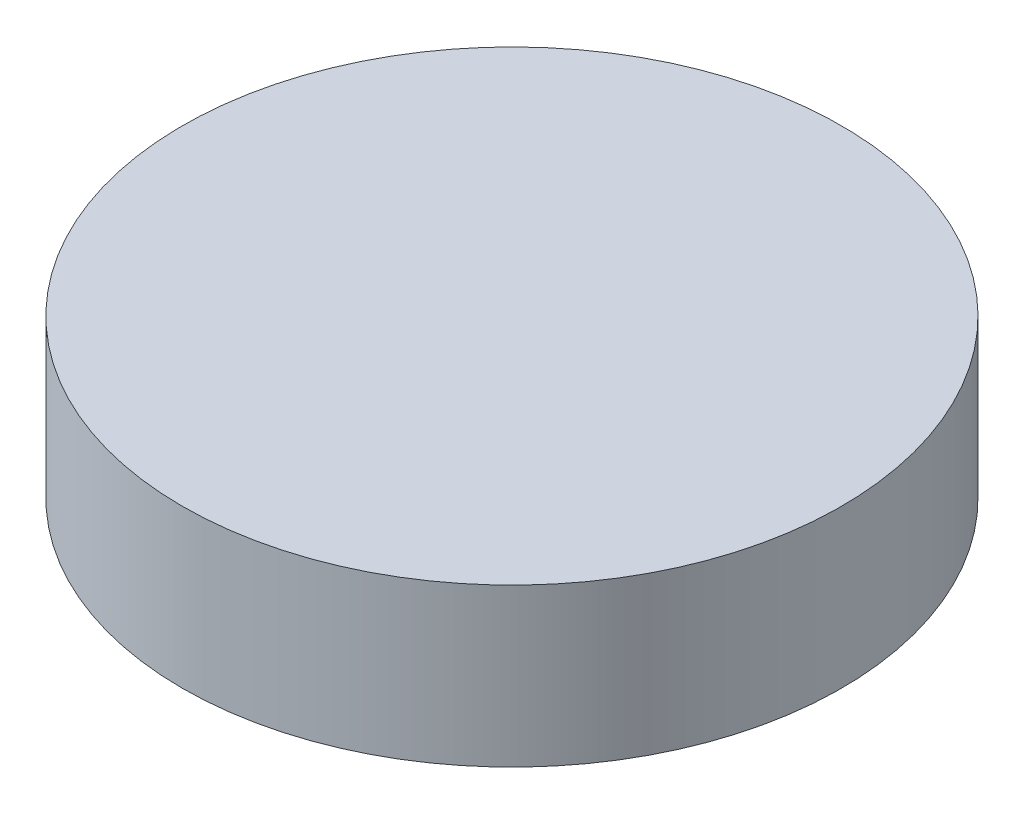
ISO-10303-21;
HEADER;
FILE_DESCRIPTION(('STEP AP214'),'2;1');
FILE_NAME('part.step','',(''),(''),'','','');
FILE_SCHEMA(('AUTOMOTIVE_DESIGN { 1 0 10303 214 1 1 1 1 }'));
ENDSEC;
DATA;
#1=APPLICATION_CONTEXT('core data for automotive mechanical design processes');
#2=APPLICATION_PROTOCOL_DEFINITION('international standard','automotive_design',2000,#1);
#3=PRODUCT_CONTEXT('',#1,'mechanical');
#4=PRODUCT('Part','Part','',(#3));
#5=PRODUCT_RELATED_PRODUCT_CATEGORY('part','',(#4));
#6=PRODUCT_DEFINITION_FORMATION('','',#4);
#7=PRODUCT_DEFINITION_CONTEXT('part definition',#1,'design');
#8=PRODUCT_DEFINITION('design','',#6,#7);
#9=PRODUCT_DEFINITION_SHAPE('','',#8);
#10=(LENGTH_UNIT() NAMED_UNIT(*) SI_UNIT(.MILLI.,.METRE.));
#11=(NAMED_UNIT(*) PLANE_ANGLE_UNIT() SI_UNIT($,.RADIAN.));
#12=(NAMED_UNIT(*) SI_UNIT($,.STERADIAN.) SOLID_ANGLE_UNIT());
#13=UNCERTAINTY_MEASURE_WITH_UNIT(LENGTH_MEASURE(1.E-05),#10,'distance_accuracy_value','');
#14=(GEOMETRIC_REPRESENTATION_CONTEXT(3) GLOBAL_UNCERTAINTY_ASSIGNED_CONTEXT((#13)) GLOBAL_UNIT_ASSIGNED_CONTEXT((#10,
#11,#12)) REPRESENTATION_CONTEXT('',''));
#15=CARTESIAN_POINT('',(0.,0.,0.));
#16=DIRECTION('',(0.,0.,1.));
#17=DIRECTION('',(1.,0.,0.));
#18=AXIS2_PLACEMENT_3D('',#15,#16,#17);
#19=CARTESIAN_POINT('',(0.,3.175,0.));
#20=DIRECTION('',(0.,-1.,0.));
#21=DIRECTION('',(0.,0.,-1.));
#22=AXIS2_PLACEMENT_3D('',#19,#20,#21);
#23=CYLINDRICAL_SURFACE('',#22,6.6378);
#24=CARTESIAN_POINT('',(0.,3.175,0.));
#25=DIRECTION('',(0.,1.,0.));
#26=DIRECTION('',(0.,0.,1.));
#27=AXIS2_PLACEMENT_3D('',#24,#25,#26);
#28=CIRCLE('',#27,6.6378);
#29=CARTESIAN_POINT('',(0.,3.175,6.6378));
#30=VERTEX_POINT('',#29);
#31=EDGE_CURVE('E10',#30,#30,#28,.T.);
#32=ORIENTED_EDGE('',*,*,#31,.F.);
#33=EDGE_LOOP('',(#32));
#34=FACE_BOUND('',#33,.T.);
#35=CARTESIAN_POINT('',(0.,0.,0.));
#36=DIRECTION('',(0.,1.,0.));
#37=DIRECTION('',(0.,0.,1.));
#38=AXIS2_PLACEMENT_3D('',#35,#36,#37);
#39=CIRCLE('',#38,6.6378);
#40=CARTESIAN_POINT('',(0.,0.,6.6378));
#41=VERTEX_POINT('',#40);
#42=EDGE_CURVE('E34',#41,#41,#39,.T.);
#43=ORIENTED_EDGE('',*,*,#42,.T.);
#44=EDGE_LOOP('',(#43));
#45=FACE_BOUND('',#44,.T.);
#46=ADVANCED_FACE('F31',(#34,#45),#23,.T.);
#47=CARTESIAN_POINT('',(0.,3.175,0.));
#48=DIRECTION('',(0.,1.,0.));
#49=DIRECTION('',(0.,0.,1.));
#50=AXIS2_PLACEMENT_3D('',#47,#48,#49);
#51=PLANE('',#50);
#52=ORIENTED_EDGE('',*,*,#31,.T.);
#53=EDGE_LOOP('',(#52));
#54=FACE_BOUND('',#53,.T.);
#55=ADVANCED_FACE('F46',(#54),#51,.T.);
#56=CARTESIAN_POINT('',(0.,0.,0.));
#57=DIRECTION('',(0.,1.,0.));
#58=DIRECTION('',(0.,0.,1.));
#59=AXIS2_PLACEMENT_3D('',#56,#57,#58);
#60=PLANE('',#59);
#61=ORIENTED_EDGE('',*,*,#42,.F.);
#62=EDGE_LOOP('',(#61));
#63=FACE_BOUND('',#62,.T.);
#64=ADVANCED_FACE('F44',(#63),#60,.F.);
#65=CLOSED_SHELL('',(#46,#55,#64));
#66=MANIFOLD_SOLID_BREP('B2',#65);
#67=ADVANCED_BREP_SHAPE_REPRESENTATION('',(#18,#66),#14);
#68=SHAPE_DEFINITION_REPRESENTATION(#9,#67);
ENDSEC;
END-ISO-10303-21;
